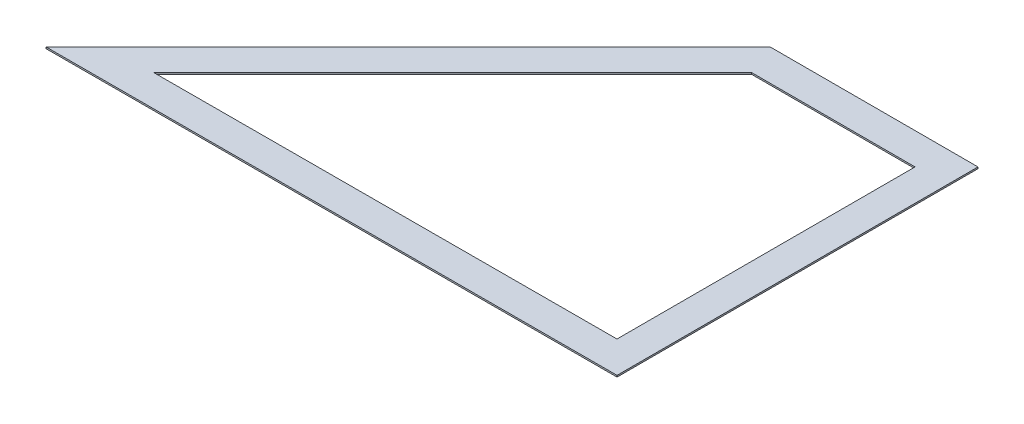
ISO-10303-21;
HEADER;
FILE_DESCRIPTION(('STEP AP214'),'2;1');
FILE_NAME('part.step','',(''),(''),'','','');
FILE_SCHEMA(('AUTOMOTIVE_DESIGN { 1 0 10303 214 1 1 1 1 }'));
ENDSEC;
DATA;
#1=APPLICATION_CONTEXT('core data for automotive mechanical design processes');
#2=APPLICATION_PROTOCOL_DEFINITION('international standard','automotive_design',2000,#1);
#3=PRODUCT_CONTEXT('',#1,'mechanical');
#4=PRODUCT('Part','Part','',(#3));
#5=PRODUCT_RELATED_PRODUCT_CATEGORY('part','',(#4));
#6=PRODUCT_DEFINITION_FORMATION('','',#4);
#7=PRODUCT_DEFINITION_CONTEXT('part definition',#1,'design');
#8=PRODUCT_DEFINITION('design','',#6,#7);
#9=PRODUCT_DEFINITION_SHAPE('','',#8);
#10=(LENGTH_UNIT() NAMED_UNIT(*) SI_UNIT(.MILLI.,.METRE.));
#11=(NAMED_UNIT(*) PLANE_ANGLE_UNIT() SI_UNIT($,.RADIAN.));
#12=(NAMED_UNIT(*) SI_UNIT($,.STERADIAN.) SOLID_ANGLE_UNIT());
#13=UNCERTAINTY_MEASURE_WITH_UNIT(LENGTH_MEASURE(1.E-05),#10,'distance_accuracy_value','');
#14=(GEOMETRIC_REPRESENTATION_CONTEXT(3) GLOBAL_UNCERTAINTY_ASSIGNED_CONTEXT((#13)) GLOBAL_UNIT_ASSIGNED_CONTEXT((#10,
#11,#12)) REPRESENTATION_CONTEXT('',''));
#15=CARTESIAN_POINT('',(0.,0.,0.));
#16=DIRECTION('',(0.,0.,1.));
#17=DIRECTION('',(1.,0.,0.));
#18=AXIS2_PLACEMENT_3D('',#15,#16,#17);
#19=CARTESIAN_POINT('',(0.,0.,0.));
#20=DIRECTION('',(0.,1.,0.));
#21=DIRECTION('',(0.,0.,1.));
#22=AXIS2_PLACEMENT_3D('',#19,#20,#21);
#23=PLANE('',#22);
#24=DIRECTION('',(-1.,0.,0.));
#25=VECTOR('',#24,1.);
#26=CARTESIAN_POINT('',(0.,0.,0.));
#27=LINE('',#26,#25);
#28=CARTESIAN_POINT('',(-7.52588429174434E-12,0.,0.));
#29=VERTEX_POINT('',#28);
#30=CARTESIAN_POINT('',(-335.63813318523,0.,0.));
#31=VERTEX_POINT('',#30);
#32=EDGE_CURVE('E122',#29,#31,#27,.T.);
#33=ORIENTED_EDGE('',*,*,#32,.F.);
#34=DIRECTION('',(0.,0.,-1.));
#35=VECTOR('',#34,1.);
#36=CARTESIAN_POINT('',(0.,0.,0.));
#37=LINE('',#36,#35);
#38=CARTESIAN_POINT('',(-1.50219496920919E-11,0.,582.663717789726));
#39=VERTEX_POINT('',#38);
#40=EDGE_CURVE('E117',#39,#29,#37,.T.);
#41=ORIENTED_EDGE('',*,*,#40,.F.);
#42=DIRECTION('',(-0.999998162842163,0.,0.00191684957655566));
#43=VECTOR('',#42,1.);
#44=CARTESIAN_POINT('',(1.11687664883712,0.,582.661576901261));
#45=LINE('',#44,#43);
#46=CARTESIAN_POINT('',(-920.065481343341,0.,584.427348158109));
#47=VERTEX_POINT('',#46);
#48=EDGE_CURVE('E114',#39,#47,#45,.T.);
#49=ORIENTED_EDGE('',*,*,#48,.T.);
#50=DIRECTION('',(0.707106781186549,0.,-0.707106781186547));
#51=VECTOR('',#50,1.);
#52=CARTESIAN_POINT('',(-167.819066592615,0.,-167.819066592615));
#53=LINE('',#52,#51);
#54=EDGE_CURVE('E110',#47,#31,#53,.T.);
#55=ORIENTED_EDGE('',*,*,#54,.T.);
#56=EDGE_LOOP('',(#33,#41,#49,#55));
#57=FACE_BOUND('',#56,.T.);
#58=DIRECTION('',(-0.999998162842163,0.,0.00191684957655561));
#59=VECTOR('',#58,1.);
#60=CARTESIAN_POINT('',(1.01950069034807,0.,531.861670228879));
#61=LINE('',#60,#59);
#62=CARTESIAN_POINT('',(-50.8000000000001,0.,531.96100059932));
#63=VERTEX_POINT('',#62);
#64=CARTESIAN_POINT('',(-797.187800583943,0.,533.391716367266));
#65=VERTEX_POINT('',#64);
#66=EDGE_CURVE('E104',#63,#65,#61,.T.);
#67=ORIENTED_EDGE('',*,*,#66,.F.);
#68=DIRECTION('',(0.,0.,-1.));
#69=VECTOR('',#68,1.);
#70=CARTESIAN_POINT('',(-50.8000000000001,0.,0.));
#71=LINE('',#70,#69);
#72=CARTESIAN_POINT('',(-50.8000000000001,0.,50.8));
#73=VERTEX_POINT('',#72);
#74=EDGE_CURVE('E93',#63,#73,#71,.T.);
#75=ORIENTED_EDGE('',*,*,#74,.T.);
#76=DIRECTION('',(-1.,0.,0.));
#77=VECTOR('',#76,1.);
#78=CARTESIAN_POINT('',(0.,0.,50.8));
#79=LINE('',#78,#77);
#80=CARTESIAN_POINT('',(-314.596084216677,0.,50.8));
#81=VERTEX_POINT('',#80);
#82=EDGE_CURVE('E80',#73,#81,#79,.T.);
#83=ORIENTED_EDGE('',*,*,#82,.T.);
#84=DIRECTION('',(0.707106781186548,0.,-0.707106781186548));
#85=VECTOR('',#84,1.);
#86=CARTESIAN_POINT('',(-131.898042108338,0.,-131.898042108338));
#87=LINE('',#86,#85);
#88=EDGE_CURVE('E20',#65,#81,#87,.T.);
#89=ORIENTED_EDGE('',*,*,#88,.F.);
#90=EDGE_LOOP('',(#67,#75,#83,#89));
#91=FACE_BOUND('',#90,.T.);
#92=ADVANCED_FACE('F17',(#57,#91),#23,.F.);
#93=CARTESIAN_POINT('',(-131.898042108338,2.54,-131.898042108338));
#94=DIRECTION('',(0.707106781186548,0.,0.707106781186548));
#95=DIRECTION('',(0.707106781186548,0.,-0.707106781186548));
#96=AXIS2_PLACEMENT_3D('',#93,#94,#95);
#97=PLANE('',#96);
#98=DIRECTION('',(0.707106781186548,0.,-0.707106781186547));
#99=VECTOR('',#98,1.);
#100=CARTESIAN_POINT('',(-797.187800583944,2.54,533.391716367266));
#101=LINE('',#100,#99);
#102=CARTESIAN_POINT('',(-797.187800583944,2.54,533.391716367267));
#103=VERTEX_POINT('',#102);
#104=CARTESIAN_POINT('',(-314.596084216677,2.54,50.8));
#105=VERTEX_POINT('',#104);
#106=EDGE_CURVE('E129',#103,#105,#101,.T.);
#107=ORIENTED_EDGE('',*,*,#106,.F.);
#108=DIRECTION('',(0.,1.,0.));
#109=VECTOR('',#108,1.);
#110=CARTESIAN_POINT('',(-797.187800583943,2.54,533.391716367266));
#111=LINE('',#110,#109);
#112=EDGE_CURVE('E89',#65,#103,#111,.T.);
#113=ORIENTED_EDGE('',*,*,#112,.F.);
#114=ORIENTED_EDGE('',*,*,#88,.T.);
#115=DIRECTION('',(0.,1.,0.));
#116=VECTOR('',#115,1.);
#117=CARTESIAN_POINT('',(-314.596084216677,2.54,50.8));
#118=LINE('',#117,#116);
#119=EDGE_CURVE('E86',#81,#105,#118,.T.);
#120=ORIENTED_EDGE('',*,*,#119,.T.);
#121=EDGE_LOOP('',(#107,#113,#114,#120));
#122=FACE_BOUND('',#121,.T.);
#123=ADVANCED_FACE('F85',(#122),#97,.T.);
#124=CARTESIAN_POINT('',(0.,2.54,50.8));
#125=DIRECTION('',(0.,0.,-1.));
#126=DIRECTION('',(-1.,0.,0.));
#127=AXIS2_PLACEMENT_3D('',#124,#125,#126);
#128=PLANE('',#127);
#129=DIRECTION('',(0.,1.,0.));
#130=VECTOR('',#129,1.);
#131=CARTESIAN_POINT('',(-50.8000000000001,2.54,50.8));
#132=LINE('',#131,#130);
#133=CARTESIAN_POINT('',(-50.8000000000001,2.54,50.8));
#134=VERTEX_POINT('',#133);
#135=EDGE_CURVE('E95',#73,#134,#132,.T.);
#136=ORIENTED_EDGE('',*,*,#135,.T.);
#137=DIRECTION('',(1.,0.,0.));
#138=VECTOR('',#137,1.);
#139=CARTESIAN_POINT('',(0.,2.54,50.8));
#140=LINE('',#139,#138);
#141=EDGE_CURVE('E99',#105,#134,#140,.T.);
#142=ORIENTED_EDGE('',*,*,#141,.F.);
#143=ORIENTED_EDGE('',*,*,#119,.F.);
#144=ORIENTED_EDGE('',*,*,#82,.F.);
#145=EDGE_LOOP('',(#136,#142,#143,#144));
#146=FACE_BOUND('',#145,.T.);
#147=ADVANCED_FACE('F97',(#146),#128,.F.);
#148=CARTESIAN_POINT('',(-50.8000000000001,2.54,0.));
#149=DIRECTION('',(1.,0.,0.));
#150=DIRECTION('',(0.,0.,-1.));
#151=AXIS2_PLACEMENT_3D('',#148,#149,#150);
#152=PLANE('',#151);
#153=DIRECTION('',(0.,1.,0.));
#154=VECTOR('',#153,1.);
#155=CARTESIAN_POINT('',(-50.8,2.54,531.96100059932));
#156=LINE('',#155,#154);
#157=CARTESIAN_POINT('',(-50.8000000000001,2.54,531.96100059932));
#158=VERTEX_POINT('',#157);
#159=EDGE_CURVE('E107',#158,#63,#156,.F.);
#160=ORIENTED_EDGE('',*,*,#159,.F.);
#161=DIRECTION('',(0.,0.,1.));
#162=VECTOR('',#161,1.);
#163=CARTESIAN_POINT('',(-50.8000000000001,2.54,0.));
#164=LINE('',#163,#162);
#165=EDGE_CURVE('E132',#134,#158,#164,.T.);
#166=ORIENTED_EDGE('',*,*,#165,.F.);
#167=ORIENTED_EDGE('',*,*,#135,.F.);
#168=ORIENTED_EDGE('',*,*,#74,.F.);
#169=EDGE_LOOP('',(#160,#166,#167,#168));
#170=FACE_BOUND('',#169,.T.);
#171=ADVANCED_FACE('F169',(#170),#152,.F.);
#172=CARTESIAN_POINT('',(1.01950069034807,2.54,531.861670228879));
#173=DIRECTION('',(-0.00191684957655561,0.,-0.999998162842163));
#174=DIRECTION('',(-0.999998162842163,0.,0.00191684957655561));
#175=AXIS2_PLACEMENT_3D('',#172,#173,#174);
#176=PLANE('',#175);
#177=DIRECTION('',(-0.999998162842163,0.,0.00191684957655561));
#178=VECTOR('',#177,1.);
#179=CARTESIAN_POINT('',(-50.8000000000001,2.54,531.96100059932));
#180=LINE('',#179,#178);
#181=EDGE_CURVE('E135',#158,#103,#180,.T.);
#182=ORIENTED_EDGE('',*,*,#181,.F.);
#183=ORIENTED_EDGE('',*,*,#159,.T.);
#184=ORIENTED_EDGE('',*,*,#66,.T.);
#185=ORIENTED_EDGE('',*,*,#112,.T.);
#186=EDGE_LOOP('',(#182,#183,#184,#185));
#187=FACE_BOUND('',#186,.T.);
#188=ADVANCED_FACE('F161',(#187),#176,.T.);
#189=CARTESIAN_POINT('',(-167.819066592615,2.54,-167.819066592615));
#190=DIRECTION('',(0.707106781186547,0.,0.707106781186549));
#191=DIRECTION('',(0.707106781186549,0.,-0.707106781186547));
#192=AXIS2_PLACEMENT_3D('',#189,#190,#191);
#193=PLANE('',#192);
#194=DIRECTION('',(0.,1.,0.));
#195=VECTOR('',#194,1.);
#196=CARTESIAN_POINT('',(-920.065481343341,2.54,584.427348158109));
#197=LINE('',#196,#195);
#198=CARTESIAN_POINT('',(-920.065481343341,2.54,584.427348158109));
#199=VERTEX_POINT('',#198);
#200=EDGE_CURVE('E112',#47,#199,#197,.T.);
#201=ORIENTED_EDGE('',*,*,#200,.T.);
#202=DIRECTION('',(-0.707106781186549,0.,0.707106781186546));
#203=VECTOR('',#202,1.);
#204=CARTESIAN_POINT('',(-335.63813318523,2.54,0.));
#205=LINE('',#204,#203);
#206=CARTESIAN_POINT('',(-335.63813318523,2.54,0.));
#207=VERTEX_POINT('',#206);
#208=EDGE_CURVE('E138',#207,#199,#205,.T.);
#209=ORIENTED_EDGE('',*,*,#208,.F.);
#210=DIRECTION('',(0.,1.,0.));
#211=VECTOR('',#210,1.);
#212=CARTESIAN_POINT('',(-335.63813318523,2.54,0.));
#213=LINE('',#212,#211);
#214=EDGE_CURVE('E125',#31,#207,#213,.T.);
#215=ORIENTED_EDGE('',*,*,#214,.F.);
#216=ORIENTED_EDGE('',*,*,#54,.F.);
#217=EDGE_LOOP('',(#201,#209,#215,#216));
#218=FACE_BOUND('',#217,.T.);
#219=ADVANCED_FACE('F159',(#218),#193,.F.);
#220=CARTESIAN_POINT('',(1.11687664883712,2.54,582.661576901261));
#221=DIRECTION('',(-0.00191684957655566,0.,-0.999998162842163));
#222=DIRECTION('',(-0.999998162842163,0.,0.00191684957655566));
#223=AXIS2_PLACEMENT_3D('',#220,#221,#222);
#224=PLANE('',#223);
#225=DIRECTION('',(0.,1.,0.));
#226=VECTOR('',#225,1.);
#227=CARTESIAN_POINT('',(-1.49962574322574E-11,2.54,582.663717789726));
#228=LINE('',#227,#226);
#229=CARTESIAN_POINT('',(-1.50091010634346E-11,2.54,582.663717789726));
#230=VERTEX_POINT('',#229);
#231=EDGE_CURVE('E119',#230,#39,#228,.F.);
#232=ORIENTED_EDGE('',*,*,#231,.F.);
#233=DIRECTION('',(0.999998162842163,0.,-0.00191684957655554));
#234=VECTOR('',#233,1.);
#235=CARTESIAN_POINT('',(-920.065481343341,2.54,584.427348158109));
#236=LINE('',#235,#234);
#237=EDGE_CURVE('E141',#199,#230,#236,.T.);
#238=ORIENTED_EDGE('',*,*,#237,.F.);
#239=ORIENTED_EDGE('',*,*,#200,.F.);
#240=ORIENTED_EDGE('',*,*,#48,.F.);
#241=EDGE_LOOP('',(#232,#238,#239,#240));
#242=FACE_BOUND('',#241,.T.);
#243=ADVANCED_FACE('F152',(#242),#224,.F.);
#244=CARTESIAN_POINT('',(0.,2.54,0.));
#245=DIRECTION('',(1.,0.,0.));
#246=DIRECTION('',(0.,0.,-1.));
#247=AXIS2_PLACEMENT_3D('',#244,#245,#246);
#248=PLANE('',#247);
#249=DIRECTION('',(0.,0.,1.));
#250=VECTOR('',#249,1.);
#251=CARTESIAN_POINT('',(-1.49962574322574E-11,2.54,0.));
#252=LINE('',#251,#250);
#253=CARTESIAN_POINT('',(-3.7906977214878E-12,2.54,0.));
#254=VERTEX_POINT('',#253);
#255=EDGE_CURVE('E26',#230,#254,#252,.F.);
#256=ORIENTED_EDGE('',*,*,#255,.F.);
#257=ORIENTED_EDGE('',*,*,#231,.T.);
#258=ORIENTED_EDGE('',*,*,#40,.T.);
#259=DIRECTION('',(0.,1.,0.));
#260=VECTOR('',#259,1.);
#261=CARTESIAN_POINT('',(0.,2.54,0.));
#262=LINE('',#261,#260);
#263=EDGE_CURVE('E35',#254,#29,#262,.F.);
#264=ORIENTED_EDGE('',*,*,#263,.F.);
#265=EDGE_LOOP('',(#256,#257,#258,#264));
#266=FACE_BOUND('',#265,.T.);
#267=ADVANCED_FACE('F149',(#266),#248,.T.);
#268=CARTESIAN_POINT('',(0.,2.54,0.));
#269=DIRECTION('',(0.,0.,-1.));
#270=DIRECTION('',(-1.,0.,0.));
#271=AXIS2_PLACEMENT_3D('',#268,#269,#270);
#272=PLANE('',#271);
#273=DIRECTION('',(1.,0.,0.));
#274=VECTOR('',#273,1.);
#275=CARTESIAN_POINT('',(0.,2.54,0.));
#276=LINE('',#275,#274);
#277=EDGE_CURVE('E11',#254,#207,#276,.F.);
#278=ORIENTED_EDGE('',*,*,#277,.F.);
#279=ORIENTED_EDGE('',*,*,#263,.T.);
#280=ORIENTED_EDGE('',*,*,#32,.T.);
#281=ORIENTED_EDGE('',*,*,#214,.T.);
#282=EDGE_LOOP('',(#278,#279,#280,#281));
#283=FACE_BOUND('',#282,.T.);
#284=ADVANCED_FACE('F157',(#283),#272,.T.);
#285=CARTESIAN_POINT('',(0.,2.54,0.));
#286=DIRECTION('',(0.,1.,0.));
#287=DIRECTION('',(0.,0.,1.));
#288=AXIS2_PLACEMENT_3D('',#285,#286,#287);
#289=PLANE('',#288);
#290=ORIENTED_EDGE('',*,*,#255,.T.);
#291=ORIENTED_EDGE('',*,*,#277,.T.);
#292=ORIENTED_EDGE('',*,*,#208,.T.);
#293=ORIENTED_EDGE('',*,*,#237,.T.);
#294=EDGE_LOOP('',(#290,#291,#292,#293));
#295=FACE_BOUND('',#294,.T.);
#296=ORIENTED_EDGE('',*,*,#165,.T.);
#297=ORIENTED_EDGE('',*,*,#181,.T.);
#298=ORIENTED_EDGE('',*,*,#106,.T.);
#299=ORIENTED_EDGE('',*,*,#141,.T.);
#300=EDGE_LOOP('',(#296,#297,#298,#299));
#301=FACE_BOUND('',#300,.T.);
#302=ADVANCED_FACE('F146',(#295,#301),#289,.T.);
#303=CLOSED_SHELL('',(#92,#123,#147,#171,#188,#219,#243,#267,#284,#302));
#304=MANIFOLD_SOLID_BREP('B1',#303);
#305=ADVANCED_BREP_SHAPE_REPRESENTATION('',(#18,#304),#14);
#306=SHAPE_DEFINITION_REPRESENTATION(#9,#305);
ENDSEC;
END-ISO-10303-21;
